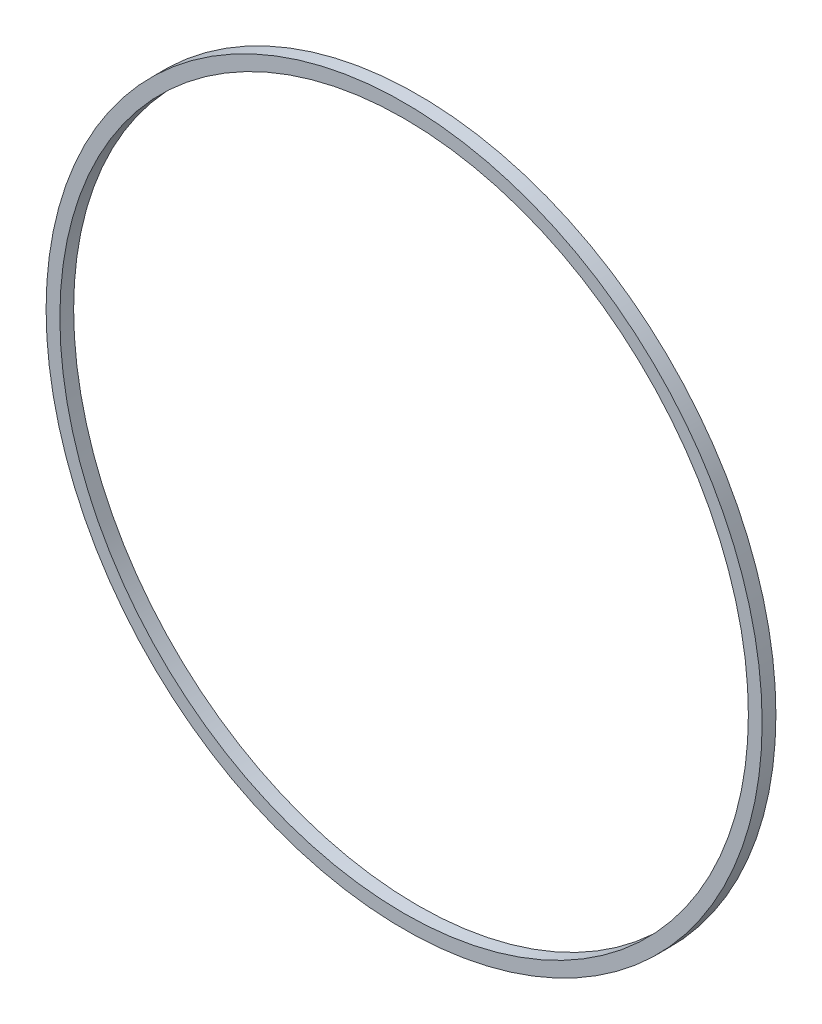
ISO-10303-21;
HEADER;
FILE_DESCRIPTION(('STEP AP214'),'2;1');
FILE_NAME('part.step','',(''),(''),'','','');
FILE_SCHEMA(('AUTOMOTIVE_DESIGN { 1 0 10303 214 1 1 1 1 }'));
ENDSEC;
DATA;
#1=APPLICATION_CONTEXT('core data for automotive mechanical design processes');
#2=APPLICATION_PROTOCOL_DEFINITION('international standard','automotive_design',2000,#1);
#3=PRODUCT_CONTEXT('',#1,'mechanical');
#4=PRODUCT('Part','Part','',(#3));
#5=PRODUCT_RELATED_PRODUCT_CATEGORY('part','',(#4));
#6=PRODUCT_DEFINITION_FORMATION('','',#4);
#7=PRODUCT_DEFINITION_CONTEXT('part definition',#1,'design');
#8=PRODUCT_DEFINITION('design','',#6,#7);
#9=PRODUCT_DEFINITION_SHAPE('','',#8);
#10=(LENGTH_UNIT() NAMED_UNIT(*) SI_UNIT(.MILLI.,.METRE.));
#11=(NAMED_UNIT(*) PLANE_ANGLE_UNIT() SI_UNIT($,.RADIAN.));
#12=(NAMED_UNIT(*) SI_UNIT($,.STERADIAN.) SOLID_ANGLE_UNIT());
#13=UNCERTAINTY_MEASURE_WITH_UNIT(LENGTH_MEASURE(1.E-05),#10,'distance_accuracy_value','');
#14=(GEOMETRIC_REPRESENTATION_CONTEXT(3) GLOBAL_UNCERTAINTY_ASSIGNED_CONTEXT((#13)) GLOBAL_UNIT_ASSIGNED_CONTEXT((#10,
#11,#12)) REPRESENTATION_CONTEXT('',''));
#15=CARTESIAN_POINT('',(0.,0.,0.));
#16=DIRECTION('',(0.,0.,1.));
#17=DIRECTION('',(1.,0.,0.));
#18=AXIS2_PLACEMENT_3D('',#15,#16,#17);
#19=CARTESIAN_POINT('',(-19.8706392627517,-20.9031785873038,2.));
#20=DIRECTION('',(0.,0.,1.));
#21=DIRECTION('',(1.,0.,0.));
#22=AXIS2_PLACEMENT_3D('',#19,#20,#21);
#23=PLANE('',#22);
#24=CARTESIAN_POINT('',(-19.8706392627517,-20.9031785873038,2.));
#25=DIRECTION('',(0.,0.,1.));
#26=DIRECTION('',(1.,0.,0.));
#27=AXIS2_PLACEMENT_3D('',#24,#25,#26);
#28=CIRCLE('',#27,52.);
#29=CARTESIAN_POINT('',(32.1293607372483,-20.9031785873038,2.));
#30=VERTEX_POINT('',#29);
#31=EDGE_CURVE('E10',#30,#30,#28,.T.);
#32=ORIENTED_EDGE('',*,*,#31,.T.);
#33=EDGE_LOOP('',(#32));
#34=FACE_BOUND('',#33,.T.);
#35=CARTESIAN_POINT('',(-19.8706392627517,-20.9031785873038,2.));
#36=DIRECTION('',(0.,0.,1.));
#37=DIRECTION('',(1.,0.,0.));
#38=AXIS2_PLACEMENT_3D('',#35,#36,#37);
#39=CIRCLE('',#38,50.);
#40=CARTESIAN_POINT('',(30.1293607372483,-20.9031785873038,2.));
#41=VERTEX_POINT('',#40);
#42=EDGE_CURVE('E50',#41,#41,#39,.T.);
#43=ORIENTED_EDGE('',*,*,#42,.F.);
#44=EDGE_LOOP('',(#43));
#45=FACE_BOUND('',#44,.T.);
#46=ADVANCED_FACE('F37',(#34,#45),#23,.T.);
#47=CARTESIAN_POINT('',(-19.8706392627517,-20.9031785873038,0.));
#48=DIRECTION('',(0.,0.,1.));
#49=DIRECTION('',(1.,0.,0.));
#50=AXIS2_PLACEMENT_3D('',#47,#48,#49);
#51=PLANE('',#50);
#52=CARTESIAN_POINT('',(-19.8706392627517,-20.9031785873038,0.));
#53=DIRECTION('',(0.,0.,1.));
#54=DIRECTION('',(1.,0.,0.));
#55=AXIS2_PLACEMENT_3D('',#52,#53,#54);
#56=CIRCLE('',#55,52.);
#57=CARTESIAN_POINT('',(32.1293607372483,-20.9031785873038,0.));
#58=VERTEX_POINT('',#57);
#59=EDGE_CURVE('E41',#58,#58,#56,.T.);
#60=ORIENTED_EDGE('',*,*,#59,.F.);
#61=EDGE_LOOP('',(#60));
#62=FACE_BOUND('',#61,.T.);
#63=CARTESIAN_POINT('',(-19.8706392627517,-20.9031785873038,0.));
#64=DIRECTION('',(0.,0.,1.));
#65=DIRECTION('',(1.,0.,0.));
#66=AXIS2_PLACEMENT_3D('',#63,#64,#65);
#67=CIRCLE('',#66,50.);
#68=CARTESIAN_POINT('',(30.1293607372483,-20.9031785873038,0.));
#69=VERTEX_POINT('',#68);
#70=EDGE_CURVE('E52',#69,#69,#67,.T.);
#71=ORIENTED_EDGE('',*,*,#70,.T.);
#72=EDGE_LOOP('',(#71));
#73=FACE_BOUND('',#72,.T.);
#74=ADVANCED_FACE('F64',(#62,#73),#51,.F.);
#75=CARTESIAN_POINT('',(-19.8706392627517,-20.9031785873038,2.));
#76=DIRECTION('',(0.,0.,-1.));
#77=DIRECTION('',(-1.,0.,0.));
#78=AXIS2_PLACEMENT_3D('',#75,#76,#77);
#79=CYLINDRICAL_SURFACE('',#78,52.);
#80=ORIENTED_EDGE('',*,*,#31,.F.);
#81=EDGE_LOOP('',(#80));
#82=FACE_BOUND('',#81,.T.);
#83=ORIENTED_EDGE('',*,*,#59,.T.);
#84=EDGE_LOOP('',(#83));
#85=FACE_BOUND('',#84,.T.);
#86=ADVANCED_FACE('F39',(#82,#85),#79,.T.);
#87=CARTESIAN_POINT('',(-19.8706392627517,-20.9031785873038,2.));
#88=DIRECTION('',(0.,0.,-1.));
#89=DIRECTION('',(-1.,0.,0.));
#90=AXIS2_PLACEMENT_3D('',#87,#88,#89);
#91=CYLINDRICAL_SURFACE('',#90,50.);
#92=ORIENTED_EDGE('',*,*,#42,.T.);
#93=EDGE_LOOP('',(#92));
#94=FACE_BOUND('',#93,.T.);
#95=ORIENTED_EDGE('',*,*,#70,.F.);
#96=EDGE_LOOP('',(#95));
#97=FACE_BOUND('',#96,.T.);
#98=ADVANCED_FACE('F60',(#94,#97),#91,.F.);
#99=CLOSED_SHELL('',(#46,#74,#86,#98));
#100=MANIFOLD_SOLID_BREP('B2',#99);
#101=ADVANCED_BREP_SHAPE_REPRESENTATION('',(#18,#100),#14);
#102=SHAPE_DEFINITION_REPRESENTATION(#9,#101);
ENDSEC;
END-ISO-10303-21;
